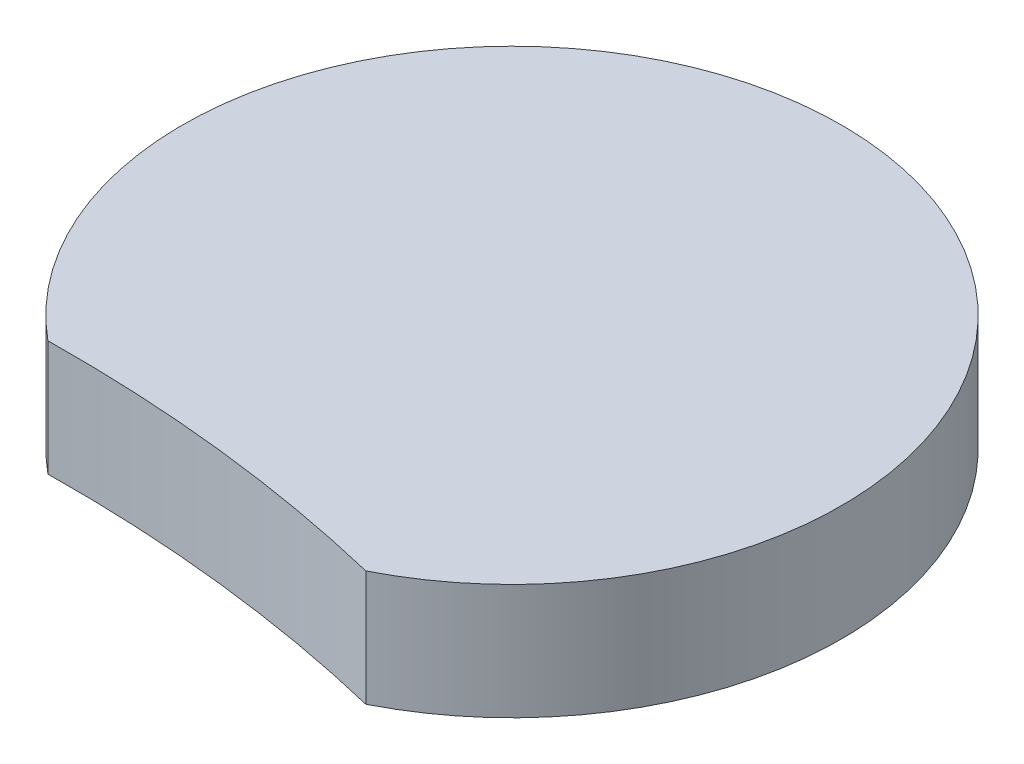
ISO-10303-21;
HEADER;
FILE_DESCRIPTION(('STEP AP214'),'2;1');
FILE_NAME('part.step','',(''),(''),'','','');
FILE_SCHEMA(('AUTOMOTIVE_DESIGN { 1 0 10303 214 1 1 1 1 }'));
ENDSEC;
DATA;
#1=APPLICATION_CONTEXT('core data for automotive mechanical design processes');
#2=APPLICATION_PROTOCOL_DEFINITION('international standard','automotive_design',2000,#1);
#3=PRODUCT_CONTEXT('',#1,'mechanical');
#4=PRODUCT('Part','Part','',(#3));
#5=PRODUCT_RELATED_PRODUCT_CATEGORY('part','',(#4));
#6=PRODUCT_DEFINITION_FORMATION('','',#4);
#7=PRODUCT_DEFINITION_CONTEXT('part definition',#1,'design');
#8=PRODUCT_DEFINITION('design','',#6,#7);
#9=PRODUCT_DEFINITION_SHAPE('','',#8);
#10=(LENGTH_UNIT() NAMED_UNIT(*) SI_UNIT(.MILLI.,.METRE.));
#11=(NAMED_UNIT(*) PLANE_ANGLE_UNIT() SI_UNIT($,.RADIAN.));
#12=(NAMED_UNIT(*) SI_UNIT($,.STERADIAN.) SOLID_ANGLE_UNIT());
#13=UNCERTAINTY_MEASURE_WITH_UNIT(LENGTH_MEASURE(1.E-05),#10,'distance_accuracy_value','');
#14=(GEOMETRIC_REPRESENTATION_CONTEXT(3) GLOBAL_UNCERTAINTY_ASSIGNED_CONTEXT((#13)) GLOBAL_UNIT_ASSIGNED_CONTEXT((#10,
#11,#12)) REPRESENTATION_CONTEXT('',''));
#15=CARTESIAN_POINT('',(0.,0.,0.));
#16=DIRECTION('',(0.,0.,1.));
#17=DIRECTION('',(1.,0.,0.));
#18=AXIS2_PLACEMENT_3D('',#15,#16,#17);
#19=CARTESIAN_POINT('',(-7.95328871124918,2.5,70.6787716705626));
#20=DIRECTION('',(0.,-1.,0.));
#21=DIRECTION('',(0.,0.,-1.));
#22=AXIS2_PLACEMENT_3D('',#19,#20,#21);
#23=CYLINDRICAL_SURFACE('',#22,59.9999999999999);
#24=CARTESIAN_POINT('',(-7.95328871124918,0.,70.6787716705626));
#25=DIRECTION('',(0.,1.,0.));
#26=DIRECTION('',(0.,0.,1.));
#27=AXIS2_PLACEMENT_3D('',#24,#25,#26);
#28=CIRCLE('',#27,59.9999999999999);
#29=CARTESIAN_POINT('',(6.15407851780513,0.,12.3608311216664));
#30=VERTEX_POINT('',#29);
#31=CARTESIAN_POINT('',(-8.73674306539437,0.,10.6838868946506));
#32=VERTEX_POINT('',#31);
#33=EDGE_CURVE('E86',#30,#32,#28,.T.);
#34=ORIENTED_EDGE('',*,*,#33,.F.);
#35=DIRECTION('',(0.,-1.,0.));
#36=VECTOR('',#35,1.);
#37=CARTESIAN_POINT('',(6.15407851780513,2.5,12.3608311216664));
#38=LINE('',#37,#36);
#39=CARTESIAN_POINT('',(6.15407851780513,4.8,12.3608311216664));
#40=VERTEX_POINT('',#39);
#41=EDGE_CURVE('E12',#40,#30,#38,.T.);
#42=ORIENTED_EDGE('',*,*,#41,.F.);
#43=CARTESIAN_POINT('',(-7.95328871124918,4.8,70.6787716705626));
#44=DIRECTION('',(0.,1.,0.));
#45=DIRECTION('',(0.,0.,1.));
#46=AXIS2_PLACEMENT_3D('',#43,#44,#45);
#47=CIRCLE('',#46,59.9999999999999);
#48=CARTESIAN_POINT('',(-8.73674306539437,4.8,10.6838868946506));
#49=VERTEX_POINT('',#48);
#50=EDGE_CURVE('E77',#49,#40,#47,.F.);
#51=ORIENTED_EDGE('',*,*,#50,.F.);
#52=DIRECTION('',(0.,-1.,0.));
#53=VECTOR('',#52,1.);
#54=CARTESIAN_POINT('',(-8.73674306539437,2.5,10.6838868946506));
#55=LINE('',#54,#53);
#56=EDGE_CURVE('E54',#49,#32,#55,.T.);
#57=ORIENTED_EDGE('',*,*,#56,.T.);
#58=EDGE_LOOP('',(#34,#42,#51,#57));
#59=FACE_BOUND('',#58,.T.);
#60=ADVANCED_FACE('F47',(#59),#23,.F.);
#61=CARTESIAN_POINT('',(-0.00778040711540452,2.5,0.124757626080607));
#62=DIRECTION('',(0.,-1.,0.));
#63=DIRECTION('',(0.,0.,-1.));
#64=AXIS2_PLACEMENT_3D('',#61,#62,#63);
#65=CYLINDRICAL_SURFACE('',#64,13.7);
#66=CARTESIAN_POINT('',(-0.00778040711540452,0.,0.124757626080607));
#67=DIRECTION('',(0.,1.,0.));
#68=DIRECTION('',(0.,0.,1.));
#69=AXIS2_PLACEMENT_3D('',#66,#67,#68);
#70=CIRCLE('',#69,13.7);
#71=EDGE_CURVE('E73',#30,#32,#70,.T.);
#72=ORIENTED_EDGE('',*,*,#71,.T.);
#73=ORIENTED_EDGE('',*,*,#56,.F.);
#74=CARTESIAN_POINT('',(-0.00778040711540452,4.8,0.124757626080607));
#75=DIRECTION('',(0.,1.,0.));
#76=DIRECTION('',(0.,0.,1.));
#77=AXIS2_PLACEMENT_3D('',#74,#75,#76);
#78=CIRCLE('',#77,13.7);
#79=EDGE_CURVE('E72',#40,#49,#78,.T.);
#80=ORIENTED_EDGE('',*,*,#79,.F.);
#81=ORIENTED_EDGE('',*,*,#41,.T.);
#82=EDGE_LOOP('',(#72,#73,#80,#81));
#83=FACE_BOUND('',#82,.T.);
#84=ADVANCED_FACE('F70',(#83),#65,.T.);
#85=CARTESIAN_POINT('',(-0.00778040711540452,2.5,0.124757626080607));
#86=DIRECTION('',(0.,-1.,0.));
#87=DIRECTION('',(0.,0.,-1.));
#88=AXIS2_PLACEMENT_3D('',#85,#86,#87);
#89=CYLINDRICAL_SURFACE('',#88,5.25);
#90=CARTESIAN_POINT('',(-0.00778040711540452,2.5,0.124757626080607));
#91=DIRECTION('',(0.,1.,0.));
#92=DIRECTION('',(0.,0.,1.));
#93=AXIS2_PLACEMENT_3D('',#90,#91,#92);
#94=CIRCLE('',#93,5.25);
#95=CARTESIAN_POINT('',(-0.00778040711540452,2.5,5.37475762608061));
#96=VERTEX_POINT('',#95);
#97=EDGE_CURVE('E79',#96,#96,#94,.T.);
#98=ORIENTED_EDGE('',*,*,#97,.T.);
#99=EDGE_LOOP('',(#98));
#100=FACE_BOUND('',#99,.T.);
#101=CARTESIAN_POINT('',(-0.00778040711540452,0.,0.124757626080607));
#102=DIRECTION('',(0.,1.,0.));
#103=DIRECTION('',(0.,0.,1.));
#104=AXIS2_PLACEMENT_3D('',#101,#102,#103);
#105=CIRCLE('',#104,5.25);
#106=CARTESIAN_POINT('',(-0.00778040711540452,0.,5.37475762608061));
#107=VERTEX_POINT('',#106);
#108=EDGE_CURVE('E75',#107,#107,#105,.T.);
#109=ORIENTED_EDGE('',*,*,#108,.F.);
#110=EDGE_LOOP('',(#109));
#111=FACE_BOUND('',#110,.T.);
#112=ADVANCED_FACE('F94',(#100,#111),#89,.F.);
#113=CARTESIAN_POINT('',(0.,0.,0.));
#114=DIRECTION('',(0.,1.,0.));
#115=DIRECTION('',(0.,0.,1.));
#116=AXIS2_PLACEMENT_3D('',#113,#114,#115);
#117=PLANE('',#116);
#118=ORIENTED_EDGE('',*,*,#33,.T.);
#119=ORIENTED_EDGE('',*,*,#71,.F.);
#120=EDGE_LOOP('',(#118,#119));
#121=FACE_BOUND('',#120,.T.);
#122=ORIENTED_EDGE('',*,*,#108,.T.);
#123=EDGE_LOOP('',(#122));
#124=FACE_BOUND('',#123,.T.);
#125=ADVANCED_FACE('F92',(#121,#124),#117,.F.);
#126=CARTESIAN_POINT('',(0.,2.5,0.));
#127=DIRECTION('',(0.,1.,0.));
#128=DIRECTION('',(0.,0.,1.));
#129=AXIS2_PLACEMENT_3D('',#126,#127,#128);
#130=PLANE('',#129);
#131=ORIENTED_EDGE('',*,*,#97,.F.);
#132=EDGE_LOOP('',(#131));
#133=FACE_BOUND('',#132,.T.);
#134=ADVANCED_FACE('F102',(#133),#130,.F.);
#135=CARTESIAN_POINT('',(0.,4.8,0.));
#136=DIRECTION('',(0.,1.,0.));
#137=DIRECTION('',(0.,0.,1.));
#138=AXIS2_PLACEMENT_3D('',#135,#136,#137);
#139=PLANE('',#138);
#140=ORIENTED_EDGE('',*,*,#79,.T.);
#141=ORIENTED_EDGE('',*,*,#50,.T.);
#142=EDGE_LOOP('',(#140,#141));
#143=FACE_BOUND('',#142,.T.);
#144=ADVANCED_FACE('F81',(#143),#139,.T.);
#145=CLOSED_SHELL('',(#60,#84,#112,#125,#134,#144));
#146=MANIFOLD_SOLID_BREP('B2',#145);
#147=ADVANCED_BREP_SHAPE_REPRESENTATION('',(#18,#146),#14);
#148=SHAPE_DEFINITION_REPRESENTATION(#9,#147);
ENDSEC;
END-ISO-10303-21;
